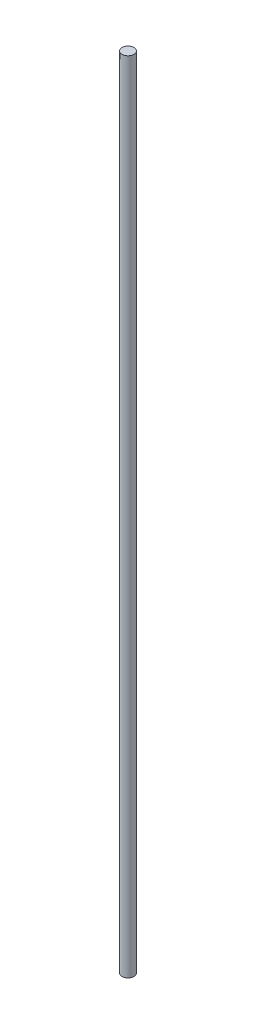
ISO-10303-21;
HEADER;
FILE_DESCRIPTION(('STEP AP214'),'2;1');
FILE_NAME('part.step','',(''),(''),'','','');
FILE_SCHEMA(('AUTOMOTIVE_DESIGN { 1 0 10303 214 1 1 1 1 }'));
ENDSEC;
DATA;
#1=APPLICATION_CONTEXT('core data for automotive mechanical design processes');
#2=APPLICATION_PROTOCOL_DEFINITION('international standard','automotive_design',2000,#1);
#3=PRODUCT_CONTEXT('',#1,'mechanical');
#4=PRODUCT('Part','Part','',(#3));
#5=PRODUCT_RELATED_PRODUCT_CATEGORY('part','',(#4));
#6=PRODUCT_DEFINITION_FORMATION('','',#4);
#7=PRODUCT_DEFINITION_CONTEXT('part definition',#1,'design');
#8=PRODUCT_DEFINITION('design','',#6,#7);
#9=PRODUCT_DEFINITION_SHAPE('','',#8);
#10=(LENGTH_UNIT() NAMED_UNIT(*) SI_UNIT(.MILLI.,.METRE.));
#11=(NAMED_UNIT(*) PLANE_ANGLE_UNIT() SI_UNIT($,.RADIAN.));
#12=(NAMED_UNIT(*) SI_UNIT($,.STERADIAN.) SOLID_ANGLE_UNIT());
#13=UNCERTAINTY_MEASURE_WITH_UNIT(LENGTH_MEASURE(1.E-05),#10,'distance_accuracy_value','');
#14=(GEOMETRIC_REPRESENTATION_CONTEXT(3) GLOBAL_UNCERTAINTY_ASSIGNED_CONTEXT((#13)) GLOBAL_UNIT_ASSIGNED_CONTEXT((#10,
#11,#12)) REPRESENTATION_CONTEXT('',''));
#15=CARTESIAN_POINT('',(0.,0.,0.));
#16=DIRECTION('',(0.,0.,1.));
#17=DIRECTION('',(1.,0.,0.));
#18=AXIS2_PLACEMENT_3D('',#15,#16,#17);
#19=CARTESIAN_POINT('',(0.,400.,0.));
#20=DIRECTION('',(0.,-1.,0.));
#21=DIRECTION('',(0.,0.,-1.));
#22=AXIS2_PLACEMENT_3D('',#19,#20,#21);
#23=CYLINDRICAL_SURFACE('',#22,3.);
#24=CARTESIAN_POINT('',(0.,400.,0.));
#25=DIRECTION('',(0.,1.,0.));
#26=DIRECTION('',(0.,0.,1.));
#27=AXIS2_PLACEMENT_3D('',#24,#25,#26);
#28=CIRCLE('',#27,3.);
#29=CARTESIAN_POINT('',(0.,400.,3.));
#30=VERTEX_POINT('',#29);
#31=EDGE_CURVE('E10',#30,#30,#28,.T.);
#32=ORIENTED_EDGE('',*,*,#31,.F.);
#33=EDGE_LOOP('',(#32));
#34=FACE_BOUND('',#33,.T.);
#35=CARTESIAN_POINT('',(0.,0.,0.));
#36=DIRECTION('',(0.,1.,0.));
#37=DIRECTION('',(0.,0.,1.));
#38=AXIS2_PLACEMENT_3D('',#35,#36,#37);
#39=CIRCLE('',#38,3.);
#40=CARTESIAN_POINT('',(0.,0.,3.));
#41=VERTEX_POINT('',#40);
#42=EDGE_CURVE('E37',#41,#41,#39,.T.);
#43=ORIENTED_EDGE('',*,*,#42,.T.);
#44=EDGE_LOOP('',(#43));
#45=FACE_BOUND('',#44,.T.);
#46=ADVANCED_FACE('F34',(#34,#45),#23,.T.);
#47=CARTESIAN_POINT('',(0.,400.,0.));
#48=DIRECTION('',(0.,1.,0.));
#49=DIRECTION('',(0.,0.,1.));
#50=AXIS2_PLACEMENT_3D('',#47,#48,#49);
#51=PLANE('',#50);
#52=ORIENTED_EDGE('',*,*,#31,.T.);
#53=EDGE_LOOP('',(#52));
#54=FACE_BOUND('',#53,.T.);
#55=ADVANCED_FACE('F49',(#54),#51,.T.);
#56=CARTESIAN_POINT('',(0.,0.,0.));
#57=DIRECTION('',(0.,1.,0.));
#58=DIRECTION('',(0.,0.,1.));
#59=AXIS2_PLACEMENT_3D('',#56,#57,#58);
#60=PLANE('',#59);
#61=ORIENTED_EDGE('',*,*,#42,.F.);
#62=EDGE_LOOP('',(#61));
#63=FACE_BOUND('',#62,.T.);
#64=ADVANCED_FACE('F47',(#63),#60,.F.);
#65=CLOSED_SHELL('',(#46,#55,#64));
#66=MANIFOLD_SOLID_BREP('B2',#65);
#67=ADVANCED_BREP_SHAPE_REPRESENTATION('',(#18,#66),#14);
#68=SHAPE_DEFINITION_REPRESENTATION(#9,#67);
ENDSEC;
END-ISO-10303-21;
